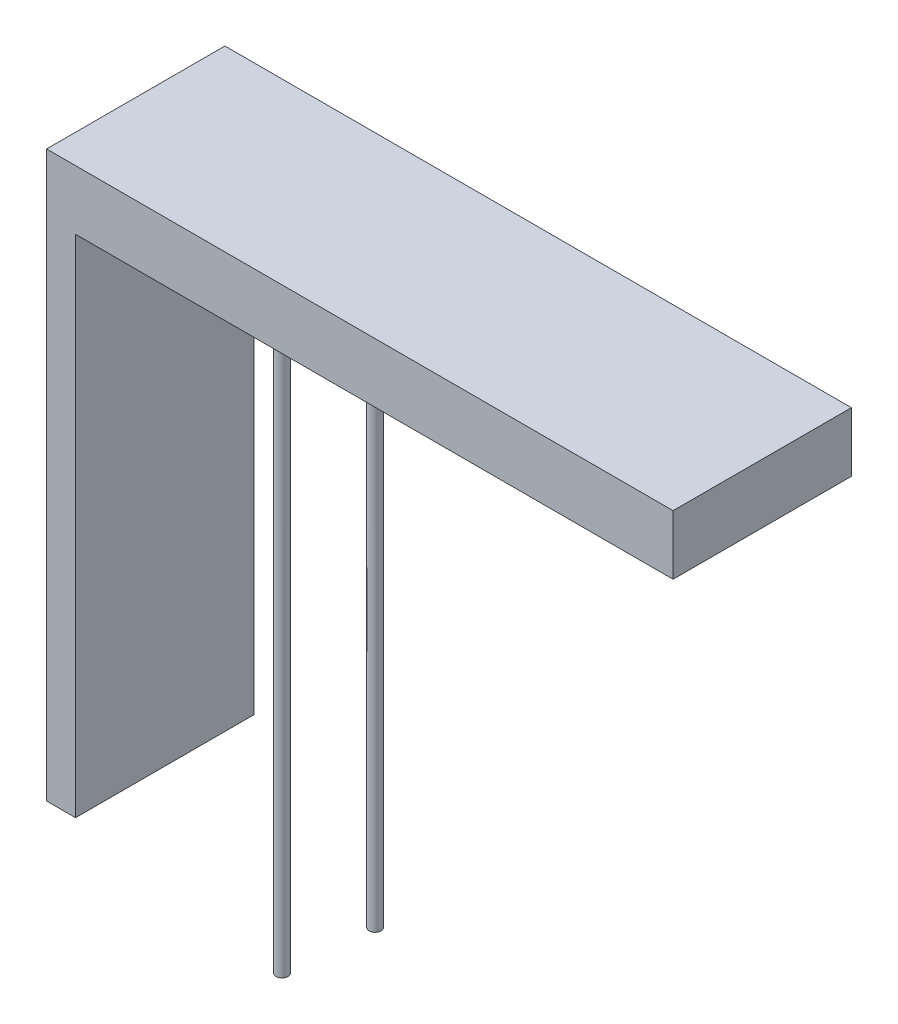
ISO-10303-21;
HEADER;
FILE_DESCRIPTION(('STEP AP214'),'2;1');
FILE_NAME('part.step','',(''),(''),'','','');
FILE_SCHEMA(('AUTOMOTIVE_DESIGN { 1 0 10303 214 1 1 1 1 }'));
ENDSEC;
DATA;
#1=APPLICATION_CONTEXT('core data for automotive mechanical design processes');
#2=APPLICATION_PROTOCOL_DEFINITION('international standard','automotive_design',2000,#1);
#3=PRODUCT_CONTEXT('',#1,'mechanical');
#4=PRODUCT('Part','Part','',(#3));
#5=PRODUCT_RELATED_PRODUCT_CATEGORY('part','',(#4));
#6=PRODUCT_DEFINITION_FORMATION('','',#4);
#7=PRODUCT_DEFINITION_CONTEXT('part definition',#1,'design');
#8=PRODUCT_DEFINITION('design','',#6,#7);
#9=PRODUCT_DEFINITION_SHAPE('','',#8);
#10=(LENGTH_UNIT() NAMED_UNIT(*) SI_UNIT(.MILLI.,.METRE.));
#11=(NAMED_UNIT(*) PLANE_ANGLE_UNIT() SI_UNIT($,.RADIAN.));
#12=(NAMED_UNIT(*) SI_UNIT($,.STERADIAN.) SOLID_ANGLE_UNIT());
#13=UNCERTAINTY_MEASURE_WITH_UNIT(LENGTH_MEASURE(1.E-05),#10,'distance_accuracy_value','');
#14=(GEOMETRIC_REPRESENTATION_CONTEXT(3) GLOBAL_UNCERTAINTY_ASSIGNED_CONTEXT((#13)) GLOBAL_UNIT_ASSIGNED_CONTEXT((#10,
#11,#12)) REPRESENTATION_CONTEXT('',''));
#15=CARTESIAN_POINT('',(0.,0.,0.));
#16=DIRECTION('',(0.,0.,1.));
#17=DIRECTION('',(1.,0.,0.));
#18=AXIS2_PLACEMENT_3D('',#15,#16,#17);
#19=CARTESIAN_POINT('',(123.733692341845,31.5,6.));
#20=DIRECTION('',(0.,1.,0.));
#21=DIRECTION('',(0.,0.,1.));
#22=AXIS2_PLACEMENT_3D('',#19,#20,#21);
#23=PLANE('',#22);
#24=CARTESIAN_POINT('',(128.735391715577,31.5,4.05666075672298));
#25=DIRECTION('',(0.,1.,0.));
#26=DIRECTION('',(0.,0.,1.));
#27=AXIS2_PLACEMENT_3D('',#24,#25,#26);
#28=CIRCLE('',#27,0.200000000000016);
#29=CARTESIAN_POINT('',(128.735391715577,31.5,4.256660756723));
#30=VERTEX_POINT('',#29);
#31=EDGE_CURVE('E43',#30,#30,#28,.F.);
#32=ORIENTED_EDGE('',*,*,#31,.F.);
#33=EDGE_LOOP('',(#32));
#34=FACE_BOUND('',#33,.T.);
#35=DIRECTION('',(1.,0.,0.));
#36=VECTOR('',#35,1.);
#37=CARTESIAN_POINT('',(123.733692341845,31.5,0.));
#38=LINE('',#37,#36);
#39=CARTESIAN_POINT('',(123.733692341845,31.5,0.));
#40=VERTEX_POINT('',#39);
#41=CARTESIAN_POINT('',(143.838461576455,31.5,0.));
#42=VERTEX_POINT('',#41);
#43=EDGE_CURVE('E126',#40,#42,#38,.T.);
#44=ORIENTED_EDGE('',*,*,#43,.T.);
#45=DIRECTION('',(0.,0.,-1.));
#46=VECTOR('',#45,1.);
#47=CARTESIAN_POINT('',(143.838461576455,31.5,6.));
#48=LINE('',#47,#46);
#49=CARTESIAN_POINT('',(143.838461576455,31.5,6.));
#50=VERTEX_POINT('',#49);
#51=EDGE_CURVE('E111',#50,#42,#48,.T.);
#52=ORIENTED_EDGE('',*,*,#51,.F.);
#53=DIRECTION('',(1.,0.,0.));
#54=VECTOR('',#53,1.);
#55=CARTESIAN_POINT('',(123.733692341845,31.5,6.));
#56=LINE('',#55,#54);
#57=CARTESIAN_POINT('',(123.733692341845,31.5,6.));
#58=VERTEX_POINT('',#57);
#59=EDGE_CURVE('E102',#58,#50,#56,.T.);
#60=ORIENTED_EDGE('',*,*,#59,.F.);
#61=DIRECTION('',(0.,0.,-1.));
#62=VECTOR('',#61,1.);
#63=CARTESIAN_POINT('',(123.733692341845,31.5,6.));
#64=LINE('',#63,#62);
#65=EDGE_CURVE('E135',#58,#40,#64,.T.);
#66=ORIENTED_EDGE('',*,*,#65,.T.);
#67=EDGE_LOOP('',(#44,#52,#60,#66));
#68=FACE_BOUND('',#67,.T.);
#69=CARTESIAN_POINT('',(128.971557812376,31.5,1.15908441523015));
#70=DIRECTION('',(0.,1.,0.));
#71=DIRECTION('',(0.,0.,1.));
#72=AXIS2_PLACEMENT_3D('',#69,#70,#71);
#73=CIRCLE('',#72,0.200000000000016);
#74=CARTESIAN_POINT('',(128.971557812376,31.5,1.35908441523016));
#75=VERTEX_POINT('',#74);
#76=EDGE_CURVE('E11',#75,#75,#73,.F.);
#77=ORIENTED_EDGE('',*,*,#76,.F.);
#78=EDGE_LOOP('',(#77));
#79=FACE_BOUND('',#78,.T.);
#80=ADVANCED_FACE('F34',(#34,#68,#79),#23,.F.);
#81=CARTESIAN_POINT('',(123.733692341845,14.5,6.));
#82=DIRECTION('',(0.,1.,0.));
#83=DIRECTION('',(0.,0.,1.));
#84=AXIS2_PLACEMENT_3D('',#81,#82,#83);
#85=PLANE('',#84);
#86=DIRECTION('',(1.,0.,0.));
#87=VECTOR('',#86,1.);
#88=CARTESIAN_POINT('',(123.733692341845,14.5,0.));
#89=LINE('',#88,#87);
#90=CARTESIAN_POINT('',(122.759551822561,14.5,0.));
#91=VERTEX_POINT('',#90);
#92=CARTESIAN_POINT('',(123.733692341845,14.5,0.));
#93=VERTEX_POINT('',#92);
#94=EDGE_CURVE('E120',#91,#93,#89,.T.);
#95=ORIENTED_EDGE('',*,*,#94,.T.);
#96=DIRECTION('',(0.,0.,-1.));
#97=VECTOR('',#96,1.);
#98=CARTESIAN_POINT('',(123.733692341845,14.5,6.));
#99=LINE('',#98,#97);
#100=CARTESIAN_POINT('',(123.733692341845,14.5,6.));
#101=VERTEX_POINT('',#100);
#102=EDGE_CURVE('E138',#101,#93,#99,.T.);
#103=ORIENTED_EDGE('',*,*,#102,.F.);
#104=DIRECTION('',(1.,0.,0.));
#105=VECTOR('',#104,1.);
#106=CARTESIAN_POINT('',(123.733692341845,14.5,6.));
#107=LINE('',#106,#105);
#108=CARTESIAN_POINT('',(122.759551822561,14.5,6.));
#109=VERTEX_POINT('',#108);
#110=EDGE_CURVE('E131',#109,#101,#107,.T.);
#111=ORIENTED_EDGE('',*,*,#110,.F.);
#112=DIRECTION('',(0.,0.,-1.));
#113=VECTOR('',#112,1.);
#114=CARTESIAN_POINT('',(122.759551822561,14.5,6.));
#115=LINE('',#114,#113);
#116=EDGE_CURVE('E116',#109,#91,#115,.T.);
#117=ORIENTED_EDGE('',*,*,#116,.T.);
#118=EDGE_LOOP('',(#95,#103,#111,#117));
#119=FACE_BOUND('',#118,.T.);
#120=ADVANCED_FACE('F36',(#119),#85,.F.);
#121=CARTESIAN_POINT('',(123.733692341845,14.5,6.));
#122=DIRECTION('',(-1.,0.,0.));
#123=DIRECTION('',(0.,0.,1.));
#124=AXIS2_PLACEMENT_3D('',#121,#122,#123);
#125=PLANE('',#124);
#126=DIRECTION('',(0.,1.,0.));
#127=VECTOR('',#126,1.);
#128=CARTESIAN_POINT('',(123.733692341845,14.5,0.));
#129=LINE('',#128,#127);
#130=EDGE_CURVE('E123',#93,#40,#129,.T.);
#131=ORIENTED_EDGE('',*,*,#130,.T.);
#132=ORIENTED_EDGE('',*,*,#65,.F.);
#133=DIRECTION('',(0.,1.,0.));
#134=VECTOR('',#133,1.);
#135=CARTESIAN_POINT('',(123.733692341845,14.5,6.));
#136=LINE('',#135,#134);
#137=EDGE_CURVE('E89',#101,#58,#136,.T.);
#138=ORIENTED_EDGE('',*,*,#137,.F.);
#139=ORIENTED_EDGE('',*,*,#102,.T.);
#140=EDGE_LOOP('',(#131,#132,#138,#139));
#141=FACE_BOUND('',#140,.T.);
#142=ADVANCED_FACE('F182',(#141),#125,.F.);
#143=CARTESIAN_POINT('',(143.838461576455,31.5,6.));
#144=DIRECTION('',(-1.,0.,0.));
#145=DIRECTION('',(0.,0.,1.));
#146=AXIS2_PLACEMENT_3D('',#143,#144,#145);
#147=PLANE('',#146);
#148=DIRECTION('',(0.,1.,0.));
#149=VECTOR('',#148,1.);
#150=CARTESIAN_POINT('',(143.838461576455,31.5,0.));
#151=LINE('',#150,#149);
#152=CARTESIAN_POINT('',(143.838461576455,33.5,0.));
#153=VERTEX_POINT('',#152);
#154=EDGE_CURVE('E110',#42,#153,#151,.T.);
#155=ORIENTED_EDGE('',*,*,#154,.T.);
#156=DIRECTION('',(0.,0.,-1.));
#157=VECTOR('',#156,1.);
#158=CARTESIAN_POINT('',(143.838461576455,33.5,6.));
#159=LINE('',#158,#157);
#160=CARTESIAN_POINT('',(143.838461576455,33.5,6.));
#161=VERTEX_POINT('',#160);
#162=EDGE_CURVE('E107',#161,#153,#159,.T.);
#163=ORIENTED_EDGE('',*,*,#162,.F.);
#164=DIRECTION('',(0.,1.,0.));
#165=VECTOR('',#164,1.);
#166=CARTESIAN_POINT('',(143.838461576455,31.5,6.));
#167=LINE('',#166,#165);
#168=EDGE_CURVE('E96',#50,#161,#167,.T.);
#169=ORIENTED_EDGE('',*,*,#168,.F.);
#170=ORIENTED_EDGE('',*,*,#51,.T.);
#171=EDGE_LOOP('',(#155,#163,#169,#170));
#172=FACE_BOUND('',#171,.T.);
#173=ADVANCED_FACE('F108',(#172),#147,.F.);
#174=CARTESIAN_POINT('',(143.838461576455,33.5,6.));
#175=DIRECTION('',(0.,-1.,0.));
#176=DIRECTION('',(0.,0.,-1.));
#177=AXIS2_PLACEMENT_3D('',#174,#175,#176);
#178=PLANE('',#177);
#179=DIRECTION('',(-1.,0.,0.));
#180=VECTOR('',#179,1.);
#181=CARTESIAN_POINT('',(143.838461576455,33.5,0.));
#182=LINE('',#181,#180);
#183=CARTESIAN_POINT('',(122.759551822561,33.5,0.));
#184=VERTEX_POINT('',#183);
#185=EDGE_CURVE('E74',#153,#184,#182,.T.);
#186=ORIENTED_EDGE('',*,*,#185,.T.);
#187=DIRECTION('',(0.,0.,-1.));
#188=VECTOR('',#187,1.);
#189=CARTESIAN_POINT('',(122.759551822561,33.5,6.));
#190=LINE('',#189,#188);
#191=CARTESIAN_POINT('',(122.759551822561,33.5,6.));
#192=VERTEX_POINT('',#191);
#193=EDGE_CURVE('E112',#192,#184,#190,.T.);
#194=ORIENTED_EDGE('',*,*,#193,.F.);
#195=DIRECTION('',(-1.,0.,0.));
#196=VECTOR('',#195,1.);
#197=CARTESIAN_POINT('',(143.838461576455,33.5,6.));
#198=LINE('',#197,#196);
#199=EDGE_CURVE('E100',#161,#192,#198,.T.);
#200=ORIENTED_EDGE('',*,*,#199,.F.);
#201=ORIENTED_EDGE('',*,*,#162,.T.);
#202=EDGE_LOOP('',(#186,#194,#200,#201));
#203=FACE_BOUND('',#202,.T.);
#204=ADVANCED_FACE('F114',(#203),#178,.F.);
#205=CARTESIAN_POINT('',(122.759551822561,14.5,6.));
#206=DIRECTION('',(1.,0.,0.));
#207=DIRECTION('',(0.,0.,-1.));
#208=AXIS2_PLACEMENT_3D('',#205,#206,#207);
#209=PLANE('',#208);
#210=DIRECTION('',(0.,-1.,0.));
#211=VECTOR('',#210,1.);
#212=CARTESIAN_POINT('',(122.759551822561,14.5,0.));
#213=LINE('',#212,#211);
#214=EDGE_CURVE('E80',#184,#91,#213,.T.);
#215=ORIENTED_EDGE('',*,*,#214,.T.);
#216=ORIENTED_EDGE('',*,*,#116,.F.);
#217=DIRECTION('',(0.,-1.,0.));
#218=VECTOR('',#217,1.);
#219=CARTESIAN_POINT('',(122.759551822561,14.5,6.));
#220=LINE('',#219,#218);
#221=EDGE_CURVE('E51',#192,#109,#220,.T.);
#222=ORIENTED_EDGE('',*,*,#221,.F.);
#223=ORIENTED_EDGE('',*,*,#193,.T.);
#224=EDGE_LOOP('',(#215,#216,#222,#223));
#225=FACE_BOUND('',#224,.T.);
#226=ADVANCED_FACE('F173',(#225),#209,.F.);
#227=CARTESIAN_POINT('',(122.759551822561,14.5,6.));
#228=DIRECTION('',(0.,0.,-1.));
#229=DIRECTION('',(-1.,0.,0.));
#230=AXIS2_PLACEMENT_3D('',#227,#228,#229);
#231=PLANE('',#230);
#232=ORIENTED_EDGE('',*,*,#110,.T.);
#233=ORIENTED_EDGE('',*,*,#137,.T.);
#234=ORIENTED_EDGE('',*,*,#59,.T.);
#235=ORIENTED_EDGE('',*,*,#168,.T.);
#236=ORIENTED_EDGE('',*,*,#199,.T.);
#237=ORIENTED_EDGE('',*,*,#221,.T.);
#238=EDGE_LOOP('',(#232,#233,#234,#235,#236,#237));
#239=FACE_BOUND('',#238,.T.);
#240=ADVANCED_FACE('F98',(#239),#231,.F.);
#241=CARTESIAN_POINT('',(122.759551822561,14.5,0.));
#242=DIRECTION('',(0.,0.,-1.));
#243=DIRECTION('',(-1.,0.,0.));
#244=AXIS2_PLACEMENT_3D('',#241,#242,#243);
#245=PLANE('',#244);
#246=ORIENTED_EDGE('',*,*,#94,.F.);
#247=ORIENTED_EDGE('',*,*,#214,.F.);
#248=ORIENTED_EDGE('',*,*,#185,.F.);
#249=ORIENTED_EDGE('',*,*,#154,.F.);
#250=ORIENTED_EDGE('',*,*,#43,.F.);
#251=ORIENTED_EDGE('',*,*,#130,.F.);
#252=EDGE_LOOP('',(#246,#247,#248,#249,#250,#251));
#253=FACE_BOUND('',#252,.T.);
#254=ADVANCED_FACE('F169',(#253),#245,.T.);
#255=CARTESIAN_POINT('',(128.735391715577,11.5,4.05666075672298));
#256=DIRECTION('',(0.,1.,0.));
#257=DIRECTION('',(0.,0.,1.));
#258=AXIS2_PLACEMENT_3D('',#255,#256,#257);
#259=CYLINDRICAL_SURFACE('',#258,0.200000000000016);
#260=CARTESIAN_POINT('',(128.735391715577,11.5,4.05666075672298));
#261=DIRECTION('',(0.,-1.,0.));
#262=DIRECTION('',(0.,0.,-1.));
#263=AXIS2_PLACEMENT_3D('',#260,#261,#262);
#264=CIRCLE('',#263,0.200000000000016);
#265=CARTESIAN_POINT('',(128.735391715577,11.5,3.85666075672297));
#266=VERTEX_POINT('',#265);
#267=EDGE_CURVE('E124',#266,#266,#264,.T.);
#268=ORIENTED_EDGE('',*,*,#267,.F.);
#269=EDGE_LOOP('',(#268));
#270=FACE_BOUND('',#269,.T.);
#271=ORIENTED_EDGE('',*,*,#31,.T.);
#272=EDGE_LOOP('',(#271));
#273=FACE_BOUND('',#272,.T.);
#274=ADVANCED_FACE('F142',(#270,#273),#259,.T.);
#275=CARTESIAN_POINT('',(128.735391715577,11.5,4.05666075672298));
#276=DIRECTION('',(0.,-1.,0.));
#277=DIRECTION('',(0.,0.,-1.));
#278=AXIS2_PLACEMENT_3D('',#275,#276,#277);
#279=PLANE('',#278);
#280=ORIENTED_EDGE('',*,*,#267,.T.);
#281=EDGE_LOOP('',(#280));
#282=FACE_BOUND('',#281,.T.);
#283=ADVANCED_FACE('F154',(#282),#279,.T.);
#284=CARTESIAN_POINT('',(128.971557812376,11.5,1.15908441523015));
#285=DIRECTION('',(0.,1.,0.));
#286=DIRECTION('',(0.,0.,1.));
#287=AXIS2_PLACEMENT_3D('',#284,#285,#286);
#288=CYLINDRICAL_SURFACE('',#287,0.200000000000016);
#289=CARTESIAN_POINT('',(128.971557812376,11.5,1.15908441523015));
#290=DIRECTION('',(0.,-1.,0.));
#291=DIRECTION('',(0.,0.,-1.));
#292=AXIS2_PLACEMENT_3D('',#289,#290,#291);
#293=CIRCLE('',#292,0.200000000000016);
#294=CARTESIAN_POINT('',(128.971557812376,11.5,0.959084415230132));
#295=VERTEX_POINT('',#294);
#296=EDGE_CURVE('E198',#295,#295,#293,.T.);
#297=ORIENTED_EDGE('',*,*,#296,.F.);
#298=EDGE_LOOP('',(#297));
#299=FACE_BOUND('',#298,.T.);
#300=ORIENTED_EDGE('',*,*,#76,.T.);
#301=EDGE_LOOP('',(#300));
#302=FACE_BOUND('',#301,.T.);
#303=ADVANCED_FACE('F151',(#299,#302),#288,.T.);
#304=CARTESIAN_POINT('',(128.971557812376,11.5,1.15908441523015));
#305=DIRECTION('',(0.,-1.,0.));
#306=DIRECTION('',(0.,0.,-1.));
#307=AXIS2_PLACEMENT_3D('',#304,#305,#306);
#308=PLANE('',#307);
#309=ORIENTED_EDGE('',*,*,#296,.T.);
#310=EDGE_LOOP('',(#309));
#311=FACE_BOUND('',#310,.T.);
#312=ADVANCED_FACE('F153',(#311),#308,.T.);
#313=CLOSED_SHELL('',(#80,#120,#142,#173,#204,#226,#240,#254,#274,#283,#303,#312));
#314=MANIFOLD_SOLID_BREP('B2',#313);
#315=ADVANCED_BREP_SHAPE_REPRESENTATION('',(#18,#314),#14);
#316=SHAPE_DEFINITION_REPRESENTATION(#9,#315);
ENDSEC;
END-ISO-10303-21;
